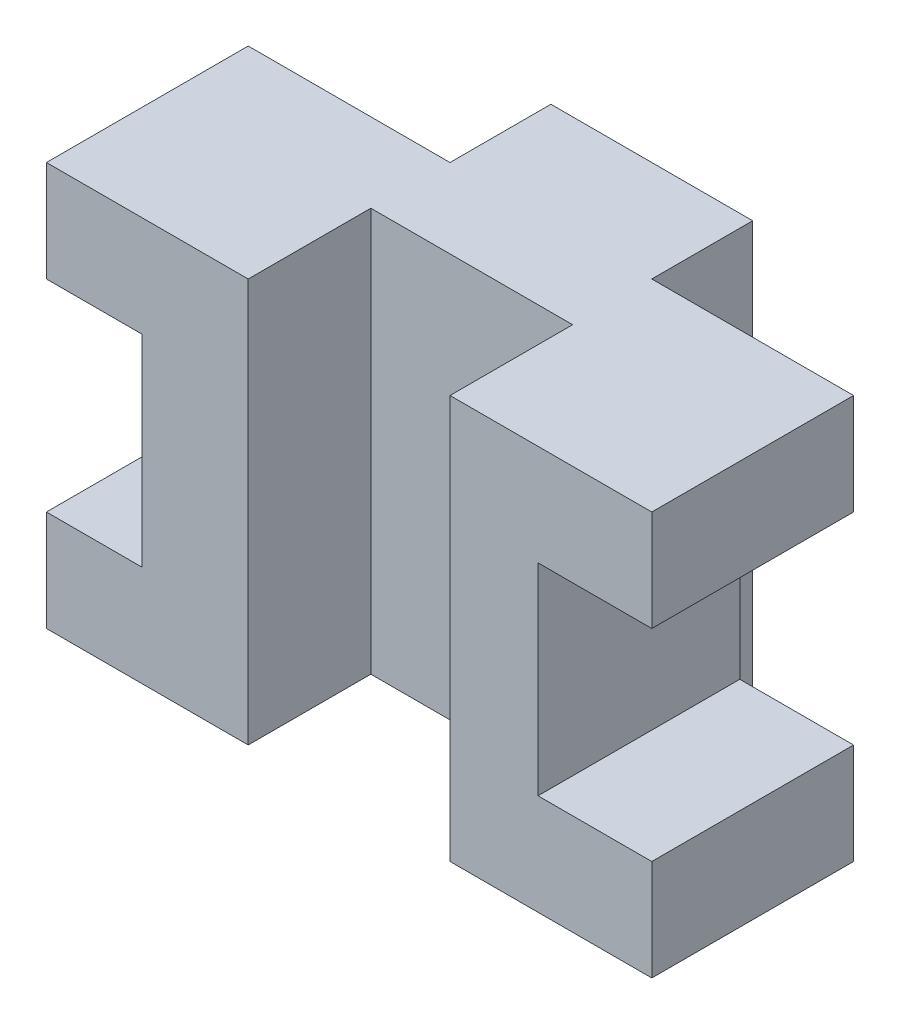
ISO-10303-21;
HEADER;
FILE_DESCRIPTION(('STEP AP214'),'2;1');
FILE_NAME('part.step','',(''),(''),'','','');
FILE_SCHEMA(('AUTOMOTIVE_DESIGN { 1 0 10303 214 1 1 1 1 }'));
ENDSEC;
DATA;
#1=APPLICATION_CONTEXT('core data for automotive mechanical design processes');
#2=APPLICATION_PROTOCOL_DEFINITION('international standard','automotive_design',2000,#1);
#3=PRODUCT_CONTEXT('',#1,'mechanical');
#4=PRODUCT('Part','Part','',(#3));
#5=PRODUCT_RELATED_PRODUCT_CATEGORY('part','',(#4));
#6=PRODUCT_DEFINITION_FORMATION('','',#4);
#7=PRODUCT_DEFINITION_CONTEXT('part definition',#1,'design');
#8=PRODUCT_DEFINITION('design','',#6,#7);
#9=PRODUCT_DEFINITION_SHAPE('','',#8);
#10=(LENGTH_UNIT() NAMED_UNIT(*) SI_UNIT(.MILLI.,.METRE.));
#11=(NAMED_UNIT(*) PLANE_ANGLE_UNIT() SI_UNIT($,.RADIAN.));
#12=(NAMED_UNIT(*) SI_UNIT($,.STERADIAN.) SOLID_ANGLE_UNIT());
#13=UNCERTAINTY_MEASURE_WITH_UNIT(LENGTH_MEASURE(1.E-05),#10,'distance_accuracy_value','');
#14=(GEOMETRIC_REPRESENTATION_CONTEXT(3) GLOBAL_UNCERTAINTY_ASSIGNED_CONTEXT((#13)) GLOBAL_UNIT_ASSIGNED_CONTEXT((#10,
#11,#12)) REPRESENTATION_CONTEXT('',''));
#15=CARTESIAN_POINT('',(0.,0.,0.));
#16=DIRECTION('',(0.,0.,1.));
#17=DIRECTION('',(1.,0.,0.));
#18=AXIS2_PLACEMENT_3D('',#15,#16,#17);
#19=CARTESIAN_POINT('',(-30.,40.,-15.));
#20=DIRECTION('',(1.,0.,0.));
#21=DIRECTION('',(0.,0.,-1.));
#22=AXIS2_PLACEMENT_3D('',#19,#20,#21);
#23=PLANE('',#22);
#24=DIRECTION('',(0.,1.,0.));
#25=VECTOR('',#24,1.);
#26=CARTESIAN_POINT('',(-30.,0.,-5.));
#27=LINE('',#26,#25);
#28=CARTESIAN_POINT('',(-30.,30.,-5.));
#29=VERTEX_POINT('',#28);
#30=CARTESIAN_POINT('',(-30.,40.,-5.));
#31=VERTEX_POINT('',#30);
#32=EDGE_CURVE('E274',#29,#31,#27,.T.);
#33=ORIENTED_EDGE('',*,*,#32,.F.);
#34=DIRECTION('',(0.,0.,1.));
#35=VECTOR('',#34,1.);
#36=CARTESIAN_POINT('',(-30.,30.,-25.));
#37=LINE('',#36,#35);
#38=CARTESIAN_POINT('',(-30.,30.,15.));
#39=VERTEX_POINT('',#38);
#40=EDGE_CURVE('E224',#29,#39,#37,.T.);
#41=ORIENTED_EDGE('',*,*,#40,.T.);
#42=DIRECTION('',(0.,-1.,0.));
#43=VECTOR('',#42,1.);
#44=CARTESIAN_POINT('',(-30.,40.,15.));
#45=LINE('',#44,#43);
#46=CARTESIAN_POINT('',(-30.,40.,15.));
#47=VERTEX_POINT('',#46);
#48=EDGE_CURVE('E198',#47,#39,#45,.T.);
#49=ORIENTED_EDGE('',*,*,#48,.F.);
#50=DIRECTION('',(0.,0.,1.));
#51=VECTOR('',#50,1.);
#52=CARTESIAN_POINT('',(-30.,40.,-15.));
#53=LINE('',#52,#51);
#54=EDGE_CURVE('E319',#31,#47,#53,.T.);
#55=ORIENTED_EDGE('',*,*,#54,.F.);
#56=EDGE_LOOP('',(#33,#41,#49,#55));
#57=FACE_BOUND('',#56,.T.);
#58=ADVANCED_FACE('F36',(#57),#23,.F.);
#59=CARTESIAN_POINT('',(30.,40.,-15.));
#60=DIRECTION('',(-1.,0.,0.));
#61=DIRECTION('',(0.,0.,1.));
#62=AXIS2_PLACEMENT_3D('',#59,#60,#61);
#63=PLANE('',#62);
#64=DIRECTION('',(0.,1.,0.));
#65=VECTOR('',#64,1.);
#66=CARTESIAN_POINT('',(30.,0.,-5.));
#67=LINE('',#66,#65);
#68=CARTESIAN_POINT('',(30.,0.,-5.));
#69=VERTEX_POINT('',#68);
#70=CARTESIAN_POINT('',(30.,10.,-5.));
#71=VERTEX_POINT('',#70);
#72=EDGE_CURVE('E259',#69,#71,#67,.T.);
#73=ORIENTED_EDGE('',*,*,#72,.T.);
#74=DIRECTION('',(0.,0.,1.));
#75=VECTOR('',#74,1.);
#76=CARTESIAN_POINT('',(30.,10.,-25.));
#77=LINE('',#76,#75);
#78=CARTESIAN_POINT('',(30.,10.,15.));
#79=VERTEX_POINT('',#78);
#80=EDGE_CURVE('E239',#71,#79,#77,.T.);
#81=ORIENTED_EDGE('',*,*,#80,.T.);
#82=DIRECTION('',(0.,-1.,0.));
#83=VECTOR('',#82,1.);
#84=CARTESIAN_POINT('',(30.,40.,15.));
#85=LINE('',#84,#83);
#86=CARTESIAN_POINT('',(30.,0.,15.));
#87=VERTEX_POINT('',#86);
#88=EDGE_CURVE('E203',#79,#87,#85,.T.);
#89=ORIENTED_EDGE('',*,*,#88,.T.);
#90=DIRECTION('',(0.,0.,-1.));
#91=VECTOR('',#90,1.);
#92=CARTESIAN_POINT('',(30.,0.,-15.));
#93=LINE('',#92,#91);
#94=EDGE_CURVE('E306',#87,#69,#93,.T.);
#95=ORIENTED_EDGE('',*,*,#94,.T.);
#96=EDGE_LOOP('',(#73,#81,#89,#95));
#97=FACE_BOUND('',#96,.T.);
#98=ADVANCED_FACE('F342',(#97),#63,.F.);
#99=CARTESIAN_POINT('',(-30.,40.,15.));
#100=DIRECTION('',(0.,0.,-1.));
#101=DIRECTION('',(-1.,0.,0.));
#102=AXIS2_PLACEMENT_3D('',#99,#100,#101);
#103=PLANE('',#102);
#104=ORIENTED_EDGE('',*,*,#48,.T.);
#105=DIRECTION('',(-1.,0.,0.));
#106=VECTOR('',#105,1.);
#107=CARTESIAN_POINT('',(-30.,30.,15.));
#108=LINE('',#107,#106);
#109=CARTESIAN_POINT('',(-20.5115003968785,30.,15.));
#110=VERTEX_POINT('',#109);
#111=EDGE_CURVE('E182',#110,#39,#108,.T.);
#112=ORIENTED_EDGE('',*,*,#111,.F.);
#113=DIRECTION('',(0.,1.,0.));
#114=VECTOR('',#113,1.);
#115=CARTESIAN_POINT('',(-20.5115003968785,30.,15.));
#116=LINE('',#115,#114);
#117=CARTESIAN_POINT('',(-20.5115003968785,10.,15.));
#118=VERTEX_POINT('',#117);
#119=EDGE_CURVE('E192',#118,#110,#116,.T.);
#120=ORIENTED_EDGE('',*,*,#119,.F.);
#121=DIRECTION('',(1.,0.,0.));
#122=VECTOR('',#121,1.);
#123=CARTESIAN_POINT('',(-30.,10.,15.));
#124=LINE('',#123,#122);
#125=CARTESIAN_POINT('',(-30.,10.,15.));
#126=VERTEX_POINT('',#125);
#127=EDGE_CURVE('E174',#126,#118,#124,.T.);
#128=ORIENTED_EDGE('',*,*,#127,.F.);
#129=CARTESIAN_POINT('',(-30.,0.,15.));
#130=VERTEX_POINT('',#129);
#131=EDGE_CURVE('E188',#126,#130,#45,.T.);
#132=ORIENTED_EDGE('',*,*,#131,.T.);
#133=DIRECTION('',(1.,0.,0.));
#134=VECTOR('',#133,1.);
#135=CARTESIAN_POINT('',(-30.,0.,15.));
#136=LINE('',#135,#134);
#137=CARTESIAN_POINT('',(-10.,0.,15.));
#138=VERTEX_POINT('',#137);
#139=EDGE_CURVE('E317',#130,#138,#136,.T.);
#140=ORIENTED_EDGE('',*,*,#139,.T.);
#141=DIRECTION('',(0.,1.,0.));
#142=VECTOR('',#141,1.);
#143=CARTESIAN_POINT('',(-10.,0.,15.));
#144=LINE('',#143,#142);
#145=CARTESIAN_POINT('',(-10.,40.,15.));
#146=VERTEX_POINT('',#145);
#147=EDGE_CURVE('E297',#138,#146,#144,.T.);
#148=ORIENTED_EDGE('',*,*,#147,.T.);
#149=DIRECTION('',(1.,0.,0.));
#150=VECTOR('',#149,1.);
#151=CARTESIAN_POINT('',(-30.,40.,15.));
#152=LINE('',#151,#150);
#153=EDGE_CURVE('E322',#47,#146,#152,.T.);
#154=ORIENTED_EDGE('',*,*,#153,.F.);
#155=EDGE_LOOP('',(#104,#112,#120,#128,#132,#140,#148,#154));
#156=FACE_BOUND('',#155,.T.);
#157=ADVANCED_FACE('F186',(#156),#103,.F.);
#158=CARTESIAN_POINT('',(30.,40.,15.));
#159=VERTEX_POINT('',#158);
#160=CARTESIAN_POINT('',(30.,30.,15.));
#161=VERTEX_POINT('',#160);
#162=EDGE_CURVE('E199',#159,#161,#85,.T.);
#163=ORIENTED_EDGE('',*,*,#162,.T.);
#164=DIRECTION('',(0.,0.,1.));
#165=VECTOR('',#164,1.);
#166=CARTESIAN_POINT('',(30.,30.,-25.));
#167=LINE('',#166,#165);
#168=CARTESIAN_POINT('',(30.,30.,-5.));
#169=VERTEX_POINT('',#168);
#170=EDGE_CURVE('E238',#169,#161,#167,.T.);
#171=ORIENTED_EDGE('',*,*,#170,.F.);
#172=CARTESIAN_POINT('',(30.,40.,-5.));
#173=VERTEX_POINT('',#172);
#174=EDGE_CURVE('E263',#169,#173,#67,.T.);
#175=ORIENTED_EDGE('',*,*,#174,.T.);
#176=DIRECTION('',(0.,0.,-1.));
#177=VECTOR('',#176,1.);
#178=CARTESIAN_POINT('',(30.,40.,-15.));
#179=LINE('',#178,#177);
#180=EDGE_CURVE('E313',#159,#173,#179,.T.);
#181=ORIENTED_EDGE('',*,*,#180,.F.);
#182=EDGE_LOOP('',(#163,#171,#175,#181));
#183=FACE_BOUND('',#182,.T.);
#184=ADVANCED_FACE('F38',(#183),#63,.F.);
#185=CARTESIAN_POINT('',(-30.,40.,-15.));
#186=DIRECTION('',(0.,0.,1.));
#187=DIRECTION('',(1.,0.,0.));
#188=AXIS2_PLACEMENT_3D('',#185,#186,#187);
#189=PLANE('',#188);
#190=DIRECTION('',(-1.,0.,0.));
#191=VECTOR('',#190,1.);
#192=CARTESIAN_POINT('',(-30.,40.,-15.));
#193=LINE('',#192,#191);
#194=CARTESIAN_POINT('',(9.99999999999999,40.,-15.));
#195=VERTEX_POINT('',#194);
#196=CARTESIAN_POINT('',(-10.,40.,-15.));
#197=VERTEX_POINT('',#196);
#198=EDGE_CURVE('E316',#195,#197,#193,.T.);
#199=ORIENTED_EDGE('',*,*,#198,.F.);
#200=DIRECTION('',(0.,1.,0.));
#201=VECTOR('',#200,1.);
#202=CARTESIAN_POINT('',(9.99999999999999,0.,-15.));
#203=LINE('',#202,#201);
#204=CARTESIAN_POINT('',(9.99999999999999,0.,-15.));
#205=VERTEX_POINT('',#204);
#206=EDGE_CURVE('E254',#205,#195,#203,.T.);
#207=ORIENTED_EDGE('',*,*,#206,.F.);
#208=DIRECTION('',(-1.,0.,0.));
#209=VECTOR('',#208,1.);
#210=CARTESIAN_POINT('',(-30.,0.,-15.));
#211=LINE('',#210,#209);
#212=CARTESIAN_POINT('',(-10.,0.,-15.));
#213=VERTEX_POINT('',#212);
#214=EDGE_CURVE('E327',#205,#213,#211,.T.);
#215=ORIENTED_EDGE('',*,*,#214,.T.);
#216=DIRECTION('',(0.,1.,0.));
#217=VECTOR('',#216,1.);
#218=CARTESIAN_POINT('',(-10.,0.,-15.));
#219=LINE('',#218,#217);
#220=EDGE_CURVE('E279',#213,#197,#219,.T.);
#221=ORIENTED_EDGE('',*,*,#220,.T.);
#222=EDGE_LOOP('',(#199,#207,#215,#221));
#223=FACE_BOUND('',#222,.T.);
#224=ADVANCED_FACE('F396',(#223),#189,.F.);
#225=ORIENTED_EDGE('',*,*,#131,.F.);
#226=DIRECTION('',(0.,0.,1.));
#227=VECTOR('',#226,1.);
#228=CARTESIAN_POINT('',(-30.,10.,-25.));
#229=LINE('',#228,#227);
#230=CARTESIAN_POINT('',(-30.,10.,-5.));
#231=VERTEX_POINT('',#230);
#232=EDGE_CURVE('E171',#231,#126,#229,.T.);
#233=ORIENTED_EDGE('',*,*,#232,.F.);
#234=CARTESIAN_POINT('',(-30.,0.,-5.));
#235=VERTEX_POINT('',#234);
#236=EDGE_CURVE('E285',#235,#231,#27,.T.);
#237=ORIENTED_EDGE('',*,*,#236,.F.);
#238=DIRECTION('',(0.,0.,1.));
#239=VECTOR('',#238,1.);
#240=CARTESIAN_POINT('',(-30.,0.,-15.));
#241=LINE('',#240,#239);
#242=EDGE_CURVE('E196',#235,#130,#241,.T.);
#243=ORIENTED_EDGE('',*,*,#242,.T.);
#244=EDGE_LOOP('',(#225,#233,#237,#243));
#245=FACE_BOUND('',#244,.T.);
#246=ADVANCED_FACE('F194',(#245),#23,.F.);
#247=ORIENTED_EDGE('',*,*,#88,.F.);
#248=DIRECTION('',(1.,0.,0.));
#249=VECTOR('',#248,1.);
#250=CARTESIAN_POINT('',(30.,10.,15.));
#251=LINE('',#250,#249);
#252=CARTESIAN_POINT('',(18.723400276258,10.,15.));
#253=VERTEX_POINT('',#252);
#254=EDGE_CURVE('E236',#253,#79,#251,.T.);
#255=ORIENTED_EDGE('',*,*,#254,.F.);
#256=DIRECTION('',(0.,-1.,0.));
#257=VECTOR('',#256,1.);
#258=CARTESIAN_POINT('',(18.723400276258,30.,15.));
#259=LINE('',#258,#257);
#260=CARTESIAN_POINT('',(18.723400276258,30.,15.));
#261=VERTEX_POINT('',#260);
#262=EDGE_CURVE('E233',#261,#253,#259,.T.);
#263=ORIENTED_EDGE('',*,*,#262,.F.);
#264=DIRECTION('',(-1.,0.,0.));
#265=VECTOR('',#264,1.);
#266=CARTESIAN_POINT('',(30.,30.,15.));
#267=LINE('',#266,#265);
#268=EDGE_CURVE('E227',#161,#261,#267,.T.);
#269=ORIENTED_EDGE('',*,*,#268,.F.);
#270=ORIENTED_EDGE('',*,*,#162,.F.);
#271=CARTESIAN_POINT('',(9.99999999999999,40.,15.));
#272=VERTEX_POINT('',#271);
#273=EDGE_CURVE('E321',#272,#159,#152,.T.);
#274=ORIENTED_EDGE('',*,*,#273,.F.);
#275=DIRECTION('',(0.,1.,0.));
#276=VECTOR('',#275,1.);
#277=CARTESIAN_POINT('',(9.99999999999999,0.,15.));
#278=LINE('',#277,#276);
#279=CARTESIAN_POINT('',(9.99999999999999,0.,15.));
#280=VERTEX_POINT('',#279);
#281=EDGE_CURVE('E309',#280,#272,#278,.T.);
#282=ORIENTED_EDGE('',*,*,#281,.F.);
#283=EDGE_CURVE('E329',#280,#87,#136,.T.);
#284=ORIENTED_EDGE('',*,*,#283,.T.);
#285=EDGE_LOOP('',(#247,#255,#263,#269,#270,#274,#282,#284));
#286=FACE_BOUND('',#285,.T.);
#287=ADVANCED_FACE('F336',(#286),#103,.F.);
#288=CARTESIAN_POINT('',(0.,40.,0.));
#289=DIRECTION('',(0.,1.,0.));
#290=DIRECTION('',(0.,0.,1.));
#291=AXIS2_PLACEMENT_3D('',#288,#289,#290);
#292=PLANE('',#291);
#293=DIRECTION('',(1.,0.,0.));
#294=VECTOR('',#293,1.);
#295=CARTESIAN_POINT('',(30.,40.,-5.));
#296=LINE('',#295,#294);
#297=CARTESIAN_POINT('',(9.99999999999999,40.,-5.));
#298=VERTEX_POINT('',#297);
#299=EDGE_CURVE('E251',#298,#173,#296,.T.);
#300=ORIENTED_EDGE('',*,*,#299,.F.);
#301=DIRECTION('',(0.,0.,1.));
#302=VECTOR('',#301,1.);
#303=CARTESIAN_POINT('',(9.99999999999999,40.,-15.));
#304=LINE('',#303,#302);
#305=EDGE_CURVE('E242',#195,#298,#304,.T.);
#306=ORIENTED_EDGE('',*,*,#305,.F.);
#307=ORIENTED_EDGE('',*,*,#198,.T.);
#308=DIRECTION('',(0.,0.,-1.));
#309=VECTOR('',#308,1.);
#310=CARTESIAN_POINT('',(-10.,40.,-15.));
#311=LINE('',#310,#309);
#312=CARTESIAN_POINT('',(-10.,40.,-5.));
#313=VERTEX_POINT('',#312);
#314=EDGE_CURVE('E271',#313,#197,#311,.T.);
#315=ORIENTED_EDGE('',*,*,#314,.F.);
#316=DIRECTION('',(1.,0.,0.));
#317=VECTOR('',#316,1.);
#318=CARTESIAN_POINT('',(-30.,40.,-5.));
#319=LINE('',#318,#317);
#320=EDGE_CURVE('E262',#31,#313,#319,.T.);
#321=ORIENTED_EDGE('',*,*,#320,.F.);
#322=ORIENTED_EDGE('',*,*,#54,.T.);
#323=ORIENTED_EDGE('',*,*,#153,.T.);
#324=DIRECTION('',(0.,0.,1.));
#325=VECTOR('',#324,1.);
#326=CARTESIAN_POINT('',(-10.,40.,15.));
#327=LINE('',#326,#325);
#328=CARTESIAN_POINT('',(-10.,40.,2.84631256528201));
#329=VERTEX_POINT('',#328);
#330=EDGE_CURVE('E282',#329,#146,#327,.T.);
#331=ORIENTED_EDGE('',*,*,#330,.F.);
#332=DIRECTION('',(-1.,0.,0.));
#333=VECTOR('',#332,1.);
#334=CARTESIAN_POINT('',(-10.,40.,2.84631256528201));
#335=LINE('',#334,#333);
#336=CARTESIAN_POINT('',(9.99999999999999,40.,2.84631256528201));
#337=VERTEX_POINT('',#336);
#338=EDGE_CURVE('E291',#337,#329,#335,.T.);
#339=ORIENTED_EDGE('',*,*,#338,.F.);
#340=DIRECTION('',(0.,0.,-1.));
#341=VECTOR('',#340,1.);
#342=CARTESIAN_POINT('',(9.99999999999999,40.,15.));
#343=LINE('',#342,#341);
#344=EDGE_CURVE('E299',#272,#337,#343,.T.);
#345=ORIENTED_EDGE('',*,*,#344,.F.);
#346=ORIENTED_EDGE('',*,*,#273,.T.);
#347=ORIENTED_EDGE('',*,*,#180,.T.);
#348=EDGE_LOOP('',(#300,#306,#307,#315,#321,#322,#323,#331,#339,#345,#346,#347));
#349=FACE_BOUND('',#348,.T.);
#350=ADVANCED_FACE('F359',(#349),#292,.T.);
#351=CARTESIAN_POINT('',(0.,0.,0.));
#352=DIRECTION('',(0.,1.,0.));
#353=DIRECTION('',(0.,0.,1.));
#354=AXIS2_PLACEMENT_3D('',#351,#352,#353);
#355=PLANE('',#354);
#356=DIRECTION('',(0.,0.,1.));
#357=VECTOR('',#356,1.);
#358=CARTESIAN_POINT('',(9.99999999999999,0.,-15.));
#359=LINE('',#358,#357);
#360=CARTESIAN_POINT('',(9.99999999999999,0.,-5.));
#361=VERTEX_POINT('',#360);
#362=EDGE_CURVE('E247',#205,#361,#359,.T.);
#363=ORIENTED_EDGE('',*,*,#362,.T.);
#364=DIRECTION('',(1.,0.,0.));
#365=VECTOR('',#364,1.);
#366=CARTESIAN_POINT('',(30.,0.,-5.));
#367=LINE('',#366,#365);
#368=EDGE_CURVE('E250',#361,#69,#367,.T.);
#369=ORIENTED_EDGE('',*,*,#368,.T.);
#370=ORIENTED_EDGE('',*,*,#94,.F.);
#371=ORIENTED_EDGE('',*,*,#283,.F.);
#372=DIRECTION('',(0.,0.,-1.));
#373=VECTOR('',#372,1.);
#374=CARTESIAN_POINT('',(9.99999999999999,0.,15.));
#375=LINE('',#374,#373);
#376=CARTESIAN_POINT('',(9.99999999999999,0.,2.84631256528201));
#377=VERTEX_POINT('',#376);
#378=EDGE_CURVE('E290',#280,#377,#375,.T.);
#379=ORIENTED_EDGE('',*,*,#378,.T.);
#380=DIRECTION('',(-1.,0.,0.));
#381=VECTOR('',#380,1.);
#382=CARTESIAN_POINT('',(-10.,0.,2.84631256528201));
#383=LINE('',#382,#381);
#384=CARTESIAN_POINT('',(-10.,0.,2.84631256528201));
#385=VERTEX_POINT('',#384);
#386=EDGE_CURVE('E294',#377,#385,#383,.T.);
#387=ORIENTED_EDGE('',*,*,#386,.T.);
#388=DIRECTION('',(0.,0.,1.));
#389=VECTOR('',#388,1.);
#390=CARTESIAN_POINT('',(-10.,0.,15.));
#391=LINE('',#390,#389);
#392=EDGE_CURVE('E287',#385,#138,#391,.T.);
#393=ORIENTED_EDGE('',*,*,#392,.T.);
#394=ORIENTED_EDGE('',*,*,#139,.F.);
#395=ORIENTED_EDGE('',*,*,#242,.F.);
#396=DIRECTION('',(1.,0.,0.));
#397=VECTOR('',#396,1.);
#398=CARTESIAN_POINT('',(-30.,0.,-5.));
#399=LINE('',#398,#397);
#400=CARTESIAN_POINT('',(-10.,0.,-5.));
#401=VERTEX_POINT('',#400);
#402=EDGE_CURVE('E267',#235,#401,#399,.T.);
#403=ORIENTED_EDGE('',*,*,#402,.T.);
#404=DIRECTION('',(0.,0.,-1.));
#405=VECTOR('',#404,1.);
#406=CARTESIAN_POINT('',(-10.,0.,-15.));
#407=LINE('',#406,#405);
#408=EDGE_CURVE('E270',#401,#213,#407,.T.);
#409=ORIENTED_EDGE('',*,*,#408,.T.);
#410=ORIENTED_EDGE('',*,*,#214,.F.);
#411=EDGE_LOOP('',(#363,#369,#370,#371,#379,#387,#393,#394,#395,#403,#409,#410));
#412=FACE_BOUND('',#411,.T.);
#413=ADVANCED_FACE('F340',(#412),#355,.F.);
#414=CARTESIAN_POINT('',(-10.,0.,15.));
#415=DIRECTION('',(-1.,0.,0.));
#416=DIRECTION('',(0.,0.,1.));
#417=AXIS2_PLACEMENT_3D('',#414,#415,#416);
#418=PLANE('',#417);
#419=ORIENTED_EDGE('',*,*,#330,.T.);
#420=ORIENTED_EDGE('',*,*,#147,.F.);
#421=ORIENTED_EDGE('',*,*,#392,.F.);
#422=DIRECTION('',(0.,1.,0.));
#423=VECTOR('',#422,1.);
#424=CARTESIAN_POINT('',(-10.,0.,2.84631256528201));
#425=LINE('',#424,#423);
#426=EDGE_CURVE('E304',#385,#329,#425,.T.);
#427=ORIENTED_EDGE('',*,*,#426,.T.);
#428=EDGE_LOOP('',(#419,#420,#421,#427));
#429=FACE_BOUND('',#428,.T.);
#430=ADVANCED_FACE('F371',(#429),#418,.F.);
#431=CARTESIAN_POINT('',(-10.,0.,2.84631256528201));
#432=DIRECTION('',(0.,0.,-1.));
#433=DIRECTION('',(-1.,0.,0.));
#434=AXIS2_PLACEMENT_3D('',#431,#432,#433);
#435=PLANE('',#434);
#436=ORIENTED_EDGE('',*,*,#338,.T.);
#437=ORIENTED_EDGE('',*,*,#426,.F.);
#438=ORIENTED_EDGE('',*,*,#386,.F.);
#439=DIRECTION('',(0.,1.,0.));
#440=VECTOR('',#439,1.);
#441=CARTESIAN_POINT('',(9.99999999999999,0.,2.84631256528201));
#442=LINE('',#441,#440);
#443=EDGE_CURVE('E307',#377,#337,#442,.T.);
#444=ORIENTED_EDGE('',*,*,#443,.T.);
#445=EDGE_LOOP('',(#436,#437,#438,#444));
#446=FACE_BOUND('',#445,.T.);
#447=ADVANCED_FACE('F369',(#446),#435,.F.);
#448=CARTESIAN_POINT('',(9.99999999999999,0.,15.));
#449=DIRECTION('',(1.,0.,0.));
#450=DIRECTION('',(0.,0.,-1.));
#451=AXIS2_PLACEMENT_3D('',#448,#449,#450);
#452=PLANE('',#451);
#453=ORIENTED_EDGE('',*,*,#344,.T.);
#454=ORIENTED_EDGE('',*,*,#443,.F.);
#455=ORIENTED_EDGE('',*,*,#378,.F.);
#456=ORIENTED_EDGE('',*,*,#281,.T.);
#457=EDGE_LOOP('',(#453,#454,#455,#456));
#458=FACE_BOUND('',#457,.T.);
#459=ADVANCED_FACE('F366',(#458),#452,.F.);
#460=CARTESIAN_POINT('',(-10.,0.,-15.));
#461=DIRECTION('',(1.,0.,0.));
#462=DIRECTION('',(0.,0.,-1.));
#463=AXIS2_PLACEMENT_3D('',#460,#461,#462);
#464=PLANE('',#463);
#465=ORIENTED_EDGE('',*,*,#314,.T.);
#466=ORIENTED_EDGE('',*,*,#220,.F.);
#467=ORIENTED_EDGE('',*,*,#408,.F.);
#468=DIRECTION('',(0.,1.,0.));
#469=VECTOR('',#468,1.);
#470=CARTESIAN_POINT('',(-10.,0.,-5.));
#471=LINE('',#470,#469);
#472=EDGE_CURVE('E283',#401,#313,#471,.T.);
#473=ORIENTED_EDGE('',*,*,#472,.T.);
#474=EDGE_LOOP('',(#465,#466,#467,#473));
#475=FACE_BOUND('',#474,.T.);
#476=ADVANCED_FACE('F410',(#475),#464,.F.);
#477=CARTESIAN_POINT('',(-30.,0.,-5.));
#478=DIRECTION('',(0.,0.,1.));
#479=DIRECTION('',(1.,0.,0.));
#480=AXIS2_PLACEMENT_3D('',#477,#478,#479);
#481=PLANE('',#480);
#482=DIRECTION('',(0.,1.,0.));
#483=VECTOR('',#482,1.);
#484=CARTESIAN_POINT('',(-20.5115003968785,0.,-5.));
#485=LINE('',#484,#483);
#486=CARTESIAN_POINT('',(-20.5115003968785,10.,-5.));
#487=VERTEX_POINT('',#486);
#488=CARTESIAN_POINT('',(-20.5115003968785,30.,-5.));
#489=VERTEX_POINT('',#488);
#490=EDGE_CURVE('E44',#487,#489,#485,.T.);
#491=ORIENTED_EDGE('',*,*,#490,.T.);
#492=DIRECTION('',(-1.,0.,0.));
#493=VECTOR('',#492,1.);
#494=CARTESIAN_POINT('',(-30.,30.,-5.));
#495=LINE('',#494,#493);
#496=EDGE_CURVE('E11',#489,#29,#495,.T.);
#497=ORIENTED_EDGE('',*,*,#496,.T.);
#498=ORIENTED_EDGE('',*,*,#32,.T.);
#499=ORIENTED_EDGE('',*,*,#320,.T.);
#500=ORIENTED_EDGE('',*,*,#472,.F.);
#501=ORIENTED_EDGE('',*,*,#402,.F.);
#502=ORIENTED_EDGE('',*,*,#236,.T.);
#503=DIRECTION('',(1.,0.,0.));
#504=VECTOR('',#503,1.);
#505=CARTESIAN_POINT('',(-30.,10.,-5.));
#506=LINE('',#505,#504);
#507=EDGE_CURVE('E177',#231,#487,#506,.T.);
#508=ORIENTED_EDGE('',*,*,#507,.T.);
#509=EDGE_LOOP('',(#491,#497,#498,#499,#500,#501,#502,#508));
#510=FACE_BOUND('',#509,.T.);
#511=ADVANCED_FACE('F217',(#510),#481,.F.);
#512=CARTESIAN_POINT('',(30.,0.,-5.));
#513=DIRECTION('',(0.,0.,1.));
#514=DIRECTION('',(1.,0.,0.));
#515=AXIS2_PLACEMENT_3D('',#512,#513,#514);
#516=PLANE('',#515);
#517=DIRECTION('',(0.,-1.,0.));
#518=VECTOR('',#517,1.);
#519=CARTESIAN_POINT('',(18.723400276258,0.,-5.));
#520=LINE('',#519,#518);
#521=CARTESIAN_POINT('',(18.723400276258,30.,-5.));
#522=VERTEX_POINT('',#521);
#523=CARTESIAN_POINT('',(18.723400276258,10.,-5.));
#524=VERTEX_POINT('',#523);
#525=EDGE_CURVE('E209',#522,#524,#520,.T.);
#526=ORIENTED_EDGE('',*,*,#525,.T.);
#527=DIRECTION('',(1.,0.,0.));
#528=VECTOR('',#527,1.);
#529=CARTESIAN_POINT('',(30.,10.,-5.));
#530=LINE('',#529,#528);
#531=EDGE_CURVE('E212',#524,#71,#530,.T.);
#532=ORIENTED_EDGE('',*,*,#531,.T.);
#533=ORIENTED_EDGE('',*,*,#72,.F.);
#534=ORIENTED_EDGE('',*,*,#368,.F.);
#535=DIRECTION('',(0.,1.,0.));
#536=VECTOR('',#535,1.);
#537=CARTESIAN_POINT('',(9.99999999999999,0.,-5.));
#538=LINE('',#537,#536);
#539=EDGE_CURVE('E264',#361,#298,#538,.T.);
#540=ORIENTED_EDGE('',*,*,#539,.T.);
#541=ORIENTED_EDGE('',*,*,#299,.T.);
#542=ORIENTED_EDGE('',*,*,#174,.F.);
#543=DIRECTION('',(-1.,0.,0.));
#544=VECTOR('',#543,1.);
#545=CARTESIAN_POINT('',(30.,30.,-5.));
#546=LINE('',#545,#544);
#547=EDGE_CURVE('E201',#169,#522,#546,.T.);
#548=ORIENTED_EDGE('',*,*,#547,.T.);
#549=EDGE_LOOP('',(#526,#532,#533,#534,#540,#541,#542,#548));
#550=FACE_BOUND('',#549,.T.);
#551=ADVANCED_FACE('F347',(#550),#516,.F.);
#552=CARTESIAN_POINT('',(9.99999999999999,0.,-15.));
#553=DIRECTION('',(-1.,0.,0.));
#554=DIRECTION('',(0.,0.,1.));
#555=AXIS2_PLACEMENT_3D('',#552,#553,#554);
#556=PLANE('',#555);
#557=ORIENTED_EDGE('',*,*,#305,.T.);
#558=ORIENTED_EDGE('',*,*,#539,.F.);
#559=ORIENTED_EDGE('',*,*,#362,.F.);
#560=ORIENTED_EDGE('',*,*,#206,.T.);
#561=EDGE_LOOP('',(#557,#558,#559,#560));
#562=FACE_BOUND('',#561,.T.);
#563=ADVANCED_FACE('F414',(#562),#556,.F.);
#564=CARTESIAN_POINT('',(30.,10.,-25.));
#565=DIRECTION('',(0.,-1.,0.));
#566=DIRECTION('',(0.,0.,-1.));
#567=AXIS2_PLACEMENT_3D('',#564,#565,#566);
#568=PLANE('',#567);
#569=DIRECTION('',(0.,0.,1.));
#570=VECTOR('',#569,1.);
#571=CARTESIAN_POINT('',(18.723400276258,10.,-25.));
#572=LINE('',#571,#570);
#573=EDGE_CURVE('E243',#524,#253,#572,.T.);
#574=ORIENTED_EDGE('',*,*,#573,.T.);
#575=ORIENTED_EDGE('',*,*,#254,.T.);
#576=ORIENTED_EDGE('',*,*,#80,.F.);
#577=ORIENTED_EDGE('',*,*,#531,.F.);
#578=EDGE_LOOP('',(#574,#575,#576,#577));
#579=FACE_BOUND('',#578,.T.);
#580=ADVANCED_FACE('F344',(#579),#568,.F.);
#581=CARTESIAN_POINT('',(18.723400276258,30.,-25.));
#582=DIRECTION('',(-1.,0.,0.));
#583=DIRECTION('',(0.,-1.,0.));
#584=AXIS2_PLACEMENT_3D('',#581,#582,#583);
#585=PLANE('',#584);
#586=DIRECTION('',(0.,0.,1.));
#587=VECTOR('',#586,1.);
#588=CARTESIAN_POINT('',(18.723400276258,30.,-25.));
#589=LINE('',#588,#587);
#590=EDGE_CURVE('E59',#522,#261,#589,.T.);
#591=ORIENTED_EDGE('',*,*,#590,.T.);
#592=ORIENTED_EDGE('',*,*,#262,.T.);
#593=ORIENTED_EDGE('',*,*,#573,.F.);
#594=ORIENTED_EDGE('',*,*,#525,.F.);
#595=EDGE_LOOP('',(#591,#592,#593,#594));
#596=FACE_BOUND('',#595,.T.);
#597=ADVANCED_FACE('F350',(#596),#585,.F.);
#598=CARTESIAN_POINT('',(30.,30.,-25.));
#599=DIRECTION('',(0.,1.,0.));
#600=DIRECTION('',(0.,0.,1.));
#601=AXIS2_PLACEMENT_3D('',#598,#599,#600);
#602=PLANE('',#601);
#603=ORIENTED_EDGE('',*,*,#170,.T.);
#604=ORIENTED_EDGE('',*,*,#268,.T.);
#605=ORIENTED_EDGE('',*,*,#590,.F.);
#606=ORIENTED_EDGE('',*,*,#547,.F.);
#607=EDGE_LOOP('',(#603,#604,#605,#606));
#608=FACE_BOUND('',#607,.T.);
#609=ADVANCED_FACE('F381',(#608),#602,.F.);
#610=CARTESIAN_POINT('',(-30.,30.,-25.));
#611=DIRECTION('',(0.,1.,0.));
#612=DIRECTION('',(0.,0.,1.));
#613=AXIS2_PLACEMENT_3D('',#610,#611,#612);
#614=PLANE('',#613);
#615=DIRECTION('',(0.,0.,1.));
#616=VECTOR('',#615,1.);
#617=CARTESIAN_POINT('',(-20.5115003968785,30.,-25.));
#618=LINE('',#617,#616);
#619=EDGE_CURVE('E222',#489,#110,#618,.T.);
#620=ORIENTED_EDGE('',*,*,#619,.T.);
#621=ORIENTED_EDGE('',*,*,#111,.T.);
#622=ORIENTED_EDGE('',*,*,#40,.F.);
#623=ORIENTED_EDGE('',*,*,#496,.F.);
#624=EDGE_LOOP('',(#620,#621,#622,#623));
#625=FACE_BOUND('',#624,.T.);
#626=ADVANCED_FACE('F379',(#625),#614,.F.);
#627=CARTESIAN_POINT('',(-20.5115003968785,30.,-25.));
#628=DIRECTION('',(1.,0.,0.));
#629=DIRECTION('',(0.,1.,0.));
#630=AXIS2_PLACEMENT_3D('',#627,#628,#629);
#631=PLANE('',#630);
#632=DIRECTION('',(0.,0.,1.));
#633=VECTOR('',#632,1.);
#634=CARTESIAN_POINT('',(-20.5115003968785,10.,-25.));
#635=LINE('',#634,#633);
#636=EDGE_CURVE('E51',#487,#118,#635,.T.);
#637=ORIENTED_EDGE('',*,*,#636,.T.);
#638=ORIENTED_EDGE('',*,*,#119,.T.);
#639=ORIENTED_EDGE('',*,*,#619,.F.);
#640=ORIENTED_EDGE('',*,*,#490,.F.);
#641=EDGE_LOOP('',(#637,#638,#639,#640));
#642=FACE_BOUND('',#641,.T.);
#643=ADVANCED_FACE('F221',(#642),#631,.F.);
#644=CARTESIAN_POINT('',(-30.,10.,-25.));
#645=DIRECTION('',(0.,-1.,0.));
#646=DIRECTION('',(0.,0.,-1.));
#647=AXIS2_PLACEMENT_3D('',#644,#645,#646);
#648=PLANE('',#647);
#649=ORIENTED_EDGE('',*,*,#232,.T.);
#650=ORIENTED_EDGE('',*,*,#127,.T.);
#651=ORIENTED_EDGE('',*,*,#636,.F.);
#652=ORIENTED_EDGE('',*,*,#507,.F.);
#653=EDGE_LOOP('',(#649,#650,#651,#652));
#654=FACE_BOUND('',#653,.T.);
#655=ADVANCED_FACE('F173',(#654),#648,.F.);
#656=CLOSED_SHELL('',(#58,#98,#157,#184,#224,#246,#287,#350,#413,#430,#447,#459,#476,#511,#551,
#563,#580,#597,#609,#626,#643,#655));
#657=MANIFOLD_SOLID_BREP('B2',#656);
#658=ADVANCED_BREP_SHAPE_REPRESENTATION('',(#18,#657),#14);
#659=SHAPE_DEFINITION_REPRESENTATION(#9,#658);
ENDSEC;
END-ISO-10303-21;
